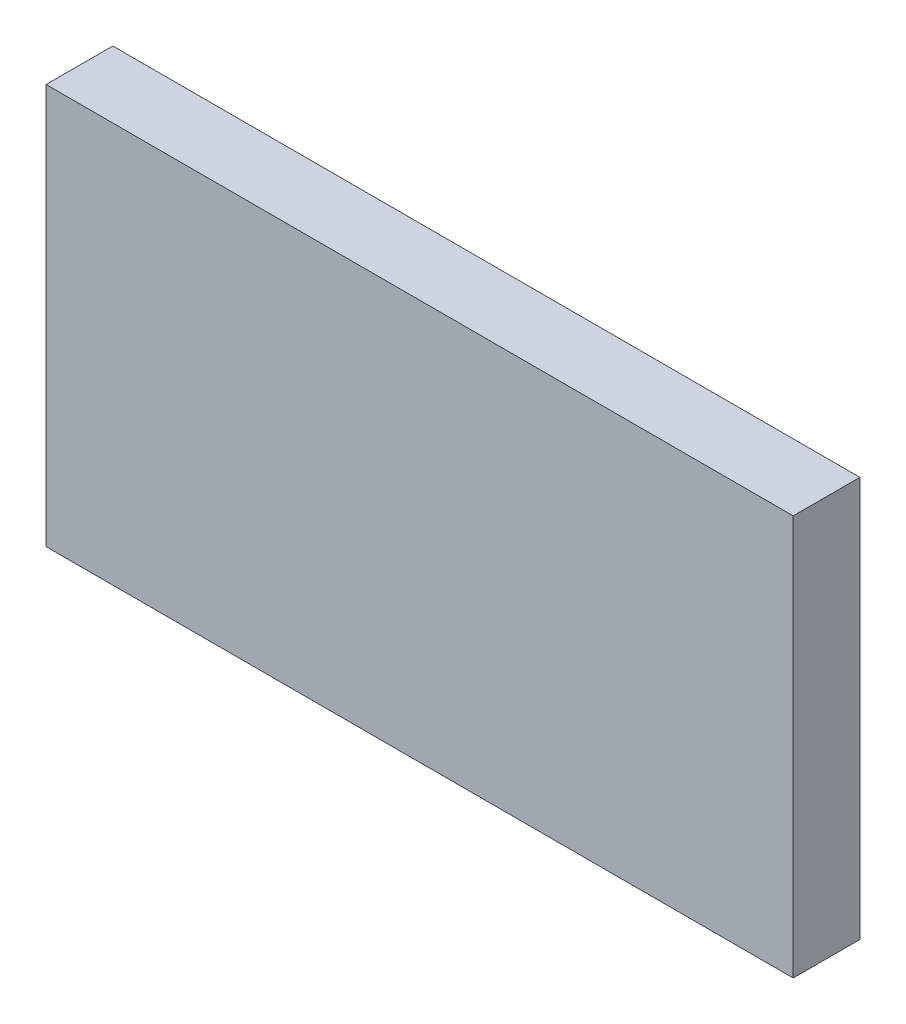
ISO-10303-21;
HEADER;
FILE_DESCRIPTION(('STEP AP214'),'2;1');
FILE_NAME('part.step','',(''),(''),'','','');
FILE_SCHEMA(('AUTOMOTIVE_DESIGN { 1 0 10303 214 1 1 1 1 }'));
ENDSEC;
DATA;
#1=APPLICATION_CONTEXT('core data for automotive mechanical design processes');
#2=APPLICATION_PROTOCOL_DEFINITION('international standard','automotive_design',2000,#1);
#3=PRODUCT_CONTEXT('',#1,'mechanical');
#4=PRODUCT('Part','Part','',(#3));
#5=PRODUCT_RELATED_PRODUCT_CATEGORY('part','',(#4));
#6=PRODUCT_DEFINITION_FORMATION('','',#4);
#7=PRODUCT_DEFINITION_CONTEXT('part definition',#1,'design');
#8=PRODUCT_DEFINITION('design','',#6,#7);
#9=PRODUCT_DEFINITION_SHAPE('','',#8);
#10=(LENGTH_UNIT() NAMED_UNIT(*) SI_UNIT(.MILLI.,.METRE.));
#11=(NAMED_UNIT(*) PLANE_ANGLE_UNIT() SI_UNIT($,.RADIAN.));
#12=(NAMED_UNIT(*) SI_UNIT($,.STERADIAN.) SOLID_ANGLE_UNIT());
#13=UNCERTAINTY_MEASURE_WITH_UNIT(LENGTH_MEASURE(1.E-05),#10,'distance_accuracy_value','');
#14=(GEOMETRIC_REPRESENTATION_CONTEXT(3) GLOBAL_UNCERTAINTY_ASSIGNED_CONTEXT((#13)) GLOBAL_UNIT_ASSIGNED_CONTEXT((#10,
#11,#12)) REPRESENTATION_CONTEXT('',''));
#15=CARTESIAN_POINT('',(0.,0.,0.));
#16=DIRECTION('',(0.,0.,1.));
#17=DIRECTION('',(1.,0.,0.));
#18=AXIS2_PLACEMENT_3D('',#15,#16,#17);
#19=CARTESIAN_POINT('',(0.864492466391478,-0.747400884353259,0.0826433070866142));
#20=DIRECTION('',(0.,0.,1.));
#21=DIRECTION('',(0.,-1.,0.));
#22=AXIS2_PLACEMENT_3D('',#19,#20,#21);
#23=PLANE('',#22);
#24=DIRECTION('',(0.,1.,0.));
#25=VECTOR('',#24,1.);
#26=CARTESIAN_POINT('',(0.790413726233998,-0.747400884353259,0.0826433070866142));
#27=LINE('',#26,#25);
#28=CARTESIAN_POINT('',(0.790413726233998,-0.745511120573731,0.0826433070866142));
#29=VERTEX_POINT('',#28);
#30=CARTESIAN_POINT('',(0.790413726233998,-0.70771584498318,0.0826433070866142));
#31=VERTEX_POINT('',#30);
#32=EDGE_CURVE('E71',#29,#31,#27,.T.);
#33=ORIENTED_EDGE('',*,*,#32,.T.);
#34=DIRECTION('',(1.,0.,0.));
#35=VECTOR('',#34,1.);
#36=CARTESIAN_POINT('',(0.864492466391478,-0.70771584498318,0.0826433070866142));
#37=LINE('',#36,#35);
#38=CARTESIAN_POINT('',(0.86096490733636,-0.70771584498318,0.0826433070866142));
#39=VERTEX_POINT('',#38);
#40=EDGE_CURVE('E54',#39,#31,#37,.F.);
#41=ORIENTED_EDGE('',*,*,#40,.F.);
#42=DIRECTION('',(0.,1.,0.));
#43=VECTOR('',#42,1.);
#44=CARTESIAN_POINT('',(0.86096490733636,-0.747400884353259,0.0826433070866142));
#45=LINE('',#44,#43);
#46=CARTESIAN_POINT('',(0.86096490733636,-0.745511120573731,0.0826433070866142));
#47=VERTEX_POINT('',#46);
#48=EDGE_CURVE('E20',#47,#39,#45,.T.);
#49=ORIENTED_EDGE('',*,*,#48,.F.);
#50=DIRECTION('',(1.,0.,0.));
#51=VECTOR('',#50,1.);
#52=CARTESIAN_POINT('',(0.78688616717888,-0.745511120573731,0.0826433070866142));
#53=LINE('',#52,#51);
#54=EDGE_CURVE('E81',#29,#47,#53,.T.);
#55=ORIENTED_EDGE('',*,*,#54,.F.);
#56=EDGE_LOOP('',(#33,#41,#49,#55));
#57=FACE_BOUND('',#56,.T.);
#58=ADVANCED_FACE('F17',(#57),#23,.F.);
#59=CARTESIAN_POINT('',(0.86096490733636,-0.747400884353259,0.0823283464566929));
#60=DIRECTION('',(-1.,0.,0.));
#61=DIRECTION('',(0.,0.,1.));
#62=AXIS2_PLACEMENT_3D('',#59,#60,#61);
#63=PLANE('',#62);
#64=DIRECTION('',(0.,0.,1.));
#65=VECTOR('',#64,1.);
#66=CARTESIAN_POINT('',(0.86096490733636,-0.745511120573731,0.0823283464566929));
#67=LINE('',#66,#65);
#68=CARTESIAN_POINT('',(0.86096490733636,-0.745511120573731,0.0889425196850394));
#69=VERTEX_POINT('',#68);
#70=EDGE_CURVE('E64',#47,#69,#67,.T.);
#71=ORIENTED_EDGE('',*,*,#70,.F.);
#72=ORIENTED_EDGE('',*,*,#48,.T.);
#73=DIRECTION('',(0.,0.,-1.));
#74=VECTOR('',#73,1.);
#75=CARTESIAN_POINT('',(0.86096490733636,-0.70771584498318,0.0823283464566929));
#76=LINE('',#75,#74);
#77=CARTESIAN_POINT('',(0.86096490733636,-0.70771584498318,0.0889425196850394));
#78=VERTEX_POINT('',#77);
#79=EDGE_CURVE('E62',#78,#39,#76,.T.);
#80=ORIENTED_EDGE('',*,*,#79,.F.);
#81=DIRECTION('',(0.,1.,0.));
#82=VECTOR('',#81,1.);
#83=CARTESIAN_POINT('',(0.86096490733636,-0.747400884353259,0.0889425196850394));
#84=LINE('',#83,#82);
#85=EDGE_CURVE('E83',#69,#78,#84,.T.);
#86=ORIENTED_EDGE('',*,*,#85,.F.);
#87=EDGE_LOOP('',(#71,#72,#80,#86));
#88=FACE_BOUND('',#87,.T.);
#89=ADVANCED_FACE('F60',(#88),#63,.F.);
#90=CARTESIAN_POINT('',(0.864492466391478,-0.70771584498318,0.0823283464566929));
#91=DIRECTION('',(0.,-1.,0.));
#92=DIRECTION('',(0.,0.,-1.));
#93=AXIS2_PLACEMENT_3D('',#90,#91,#92);
#94=PLANE('',#93);
#95=DIRECTION('',(0.,0.,1.));
#96=VECTOR('',#95,1.);
#97=CARTESIAN_POINT('',(0.790413726233998,-0.70771584498318,0.0823283464566929));
#98=LINE('',#97,#96);
#99=CARTESIAN_POINT('',(0.790413726233998,-0.70771584498318,0.0889425196850394));
#100=VERTEX_POINT('',#99);
#101=EDGE_CURVE('E73',#31,#100,#98,.T.);
#102=ORIENTED_EDGE('',*,*,#101,.T.);
#103=DIRECTION('',(1.,0.,0.));
#104=VECTOR('',#103,1.);
#105=CARTESIAN_POINT('',(0.864492466391478,-0.70771584498318,0.0889425196850394));
#106=LINE('',#105,#104);
#107=EDGE_CURVE('E69',#78,#100,#106,.F.);
#108=ORIENTED_EDGE('',*,*,#107,.F.);
#109=ORIENTED_EDGE('',*,*,#79,.T.);
#110=ORIENTED_EDGE('',*,*,#40,.T.);
#111=EDGE_LOOP('',(#102,#108,#109,#110));
#112=FACE_BOUND('',#111,.T.);
#113=ADVANCED_FACE('F68',(#112),#94,.F.);
#114=CARTESIAN_POINT('',(0.790413726233998,-0.747400884353259,0.0823283464566929));
#115=DIRECTION('',(-1.,0.,0.));
#116=DIRECTION('',(0.,0.,1.));
#117=AXIS2_PLACEMENT_3D('',#114,#115,#116);
#118=PLANE('',#117);
#119=ORIENTED_EDGE('',*,*,#32,.F.);
#120=DIRECTION('',(0.,0.,1.));
#121=VECTOR('',#120,1.);
#122=CARTESIAN_POINT('',(0.790413726233998,-0.745511120573731,0.0823283464566929));
#123=LINE('',#122,#121);
#124=CARTESIAN_POINT('',(0.790413726233998,-0.745511120573731,0.0889425196850394));
#125=VERTEX_POINT('',#124);
#126=EDGE_CURVE('E78',#125,#29,#123,.F.);
#127=ORIENTED_EDGE('',*,*,#126,.F.);
#128=DIRECTION('',(0.,1.,0.));
#129=VECTOR('',#128,1.);
#130=CARTESIAN_POINT('',(0.790413726233998,-0.747400884353259,0.0889425196850394));
#131=LINE('',#130,#129);
#132=EDGE_CURVE('E26',#100,#125,#131,.F.);
#133=ORIENTED_EDGE('',*,*,#132,.F.);
#134=ORIENTED_EDGE('',*,*,#101,.F.);
#135=EDGE_LOOP('',(#119,#127,#133,#134));
#136=FACE_BOUND('',#135,.T.);
#137=ADVANCED_FACE('F88',(#136),#118,.T.);
#138=CARTESIAN_POINT('',(0.78688616717888,-0.745511120573731,0.0823283464566929));
#139=DIRECTION('',(0.,1.,0.));
#140=DIRECTION('',(0.,0.,1.));
#141=AXIS2_PLACEMENT_3D('',#138,#139,#140);
#142=PLANE('',#141);
#143=ORIENTED_EDGE('',*,*,#126,.T.);
#144=ORIENTED_EDGE('',*,*,#54,.T.);
#145=ORIENTED_EDGE('',*,*,#70,.T.);
#146=DIRECTION('',(1.,0.,0.));
#147=VECTOR('',#146,1.);
#148=CARTESIAN_POINT('',(0.864492466391478,-0.745511120573731,0.0889425196850394));
#149=LINE('',#148,#147);
#150=EDGE_CURVE('E11',#125,#69,#149,.T.);
#151=ORIENTED_EDGE('',*,*,#150,.F.);
#152=EDGE_LOOP('',(#143,#144,#145,#151));
#153=FACE_BOUND('',#152,.T.);
#154=ADVANCED_FACE('F91',(#153),#142,.F.);
#155=CARTESIAN_POINT('',(0.864492466391478,-0.747400884353259,0.0889425196850394));
#156=DIRECTION('',(0.,0.,-1.));
#157=DIRECTION('',(0.,1.,0.));
#158=AXIS2_PLACEMENT_3D('',#155,#156,#157);
#159=PLANE('',#158);
#160=ORIENTED_EDGE('',*,*,#132,.T.);
#161=ORIENTED_EDGE('',*,*,#150,.T.);
#162=ORIENTED_EDGE('',*,*,#85,.T.);
#163=ORIENTED_EDGE('',*,*,#107,.T.);
#164=EDGE_LOOP('',(#160,#161,#162,#163));
#165=FACE_BOUND('',#164,.T.);
#166=ADVANCED_FACE('F86',(#165),#159,.F.);
#167=CLOSED_SHELL('',(#58,#89,#113,#137,#154,#166));
#168=MANIFOLD_SOLID_BREP('B1',#167);
#169=ADVANCED_BREP_SHAPE_REPRESENTATION('',(#18,#168),#14);
#170=SHAPE_DEFINITION_REPRESENTATION(#9,#169);
ENDSEC;
END-ISO-10303-21;
